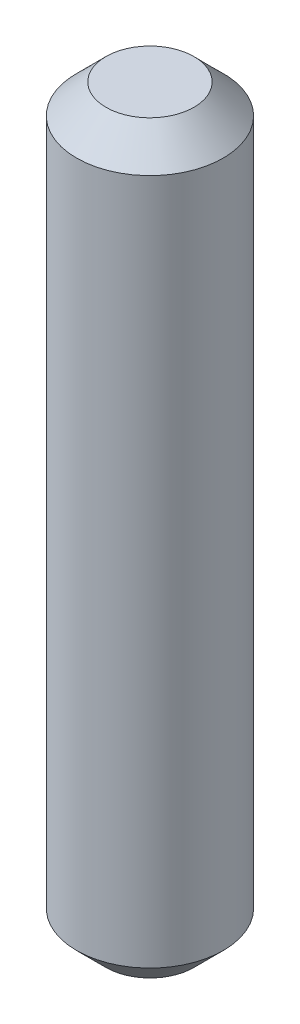
ISO-10303-21;
HEADER;
FILE_DESCRIPTION(('STEP AP214'),'2;1');
FILE_NAME('part.step','',(''),(''),'','','');
FILE_SCHEMA(('AUTOMOTIVE_DESIGN { 1 0 10303 214 1 1 1 1 }'));
ENDSEC;
DATA;
#1=APPLICATION_CONTEXT('core data for automotive mechanical design processes');
#2=APPLICATION_PROTOCOL_DEFINITION('international standard','automotive_design',2000,#1);
#3=PRODUCT_CONTEXT('',#1,'mechanical');
#4=PRODUCT('Part','Part','',(#3));
#5=PRODUCT_RELATED_PRODUCT_CATEGORY('part','',(#4));
#6=PRODUCT_DEFINITION_FORMATION('','',#4);
#7=PRODUCT_DEFINITION_CONTEXT('part definition',#1,'design');
#8=PRODUCT_DEFINITION('design','',#6,#7);
#9=PRODUCT_DEFINITION_SHAPE('','',#8);
#10=(LENGTH_UNIT() NAMED_UNIT(*) SI_UNIT(.MILLI.,.METRE.));
#11=(NAMED_UNIT(*) PLANE_ANGLE_UNIT() SI_UNIT($,.RADIAN.));
#12=(NAMED_UNIT(*) SI_UNIT($,.STERADIAN.) SOLID_ANGLE_UNIT());
#13=UNCERTAINTY_MEASURE_WITH_UNIT(LENGTH_MEASURE(1.E-05),#10,'distance_accuracy_value','');
#14=(GEOMETRIC_REPRESENTATION_CONTEXT(3) GLOBAL_UNCERTAINTY_ASSIGNED_CONTEXT((#13)) GLOBAL_UNIT_ASSIGNED_CONTEXT((#10,
#11,#12)) REPRESENTATION_CONTEXT('',''));
#15=CARTESIAN_POINT('',(0.,0.,0.));
#16=DIRECTION('',(0.,0.,1.));
#17=DIRECTION('',(1.,0.,0.));
#18=AXIS2_PLACEMENT_3D('',#15,#16,#17);
#19=CARTESIAN_POINT('',(0.,12.7,0.));
#20=DIRECTION('',(0.,-1.,0.));
#21=DIRECTION('',(0.,0.,-1.));
#22=AXIS2_PLACEMENT_3D('',#19,#20,#21);
#23=CYLINDRICAL_SURFACE('',#22,1.25);
#24=CARTESIAN_POINT('',(0.,0.500000000000004,0.));
#25=DIRECTION('',(0.,1.,0.));
#26=DIRECTION('',(0.,0.,1.));
#27=AXIS2_PLACEMENT_3D('',#24,#25,#26);
#28=CIRCLE('',#27,1.25);
#29=CARTESIAN_POINT('',(0.,0.500000000000004,1.25));
#30=VERTEX_POINT('',#29);
#31=EDGE_CURVE('E57',#30,#30,#28,.T.);
#32=ORIENTED_EDGE('',*,*,#31,.T.);
#33=EDGE_LOOP('',(#32));
#34=FACE_BOUND('',#33,.T.);
#35=CARTESIAN_POINT('',(0.,12.2,0.));
#36=DIRECTION('',(0.,1.,0.));
#37=DIRECTION('',(0.,0.,1.));
#38=AXIS2_PLACEMENT_3D('',#35,#36,#37);
#39=CIRCLE('',#38,1.25);
#40=CARTESIAN_POINT('',(0.,12.2,1.25));
#41=VERTEX_POINT('',#40);
#42=EDGE_CURVE('E61',#41,#41,#39,.F.);
#43=ORIENTED_EDGE('',*,*,#42,.T.);
#44=EDGE_LOOP('',(#43));
#45=FACE_BOUND('',#44,.T.);
#46=ADVANCED_FACE('F45',(#34,#45),#23,.T.);
#47=CARTESIAN_POINT('',(0.,12.7,0.));
#48=DIRECTION('',(0.,1.,0.));
#49=DIRECTION('',(0.,0.,1.));
#50=AXIS2_PLACEMENT_3D('',#47,#48,#49);
#51=PLANE('',#50);
#52=CARTESIAN_POINT('',(0.,12.7,0.));
#53=DIRECTION('',(0.,1.,0.));
#54=DIRECTION('',(0.,0.,1.));
#55=AXIS2_PLACEMENT_3D('',#52,#53,#54);
#56=CIRCLE('',#55,0.749999999999999);
#57=CARTESIAN_POINT('',(0.,12.7,0.749999999999999));
#58=VERTEX_POINT('',#57);
#59=EDGE_CURVE('E10',#58,#58,#56,.T.);
#60=ORIENTED_EDGE('',*,*,#59,.T.);
#61=EDGE_LOOP('',(#60));
#62=FACE_BOUND('',#61,.T.);
#63=ADVANCED_FACE('F76',(#62),#51,.T.);
#64=CARTESIAN_POINT('',(0.,0.,0.));
#65=DIRECTION('',(0.,1.,0.));
#66=DIRECTION('',(0.,0.,1.));
#67=AXIS2_PLACEMENT_3D('',#64,#65,#66);
#68=PLANE('',#67);
#69=CARTESIAN_POINT('',(0.,0.,0.));
#70=DIRECTION('',(0.,1.,0.));
#71=DIRECTION('',(0.,0.,1.));
#72=AXIS2_PLACEMENT_3D('',#69,#70,#71);
#73=CIRCLE('',#72,0.749999999999995);
#74=CARTESIAN_POINT('',(0.,0.,0.749999999999995));
#75=VERTEX_POINT('',#74);
#76=EDGE_CURVE('E53',#75,#75,#73,.F.);
#77=ORIENTED_EDGE('',*,*,#76,.T.);
#78=EDGE_LOOP('',(#77));
#79=FACE_BOUND('',#78,.T.);
#80=ADVANCED_FACE('F73',(#79),#68,.F.);
#81=CARTESIAN_POINT('',(0.,0.500000000000004,0.));
#82=DIRECTION('',(0.,1.,0.));
#83=DIRECTION('',(0.,0.,1.));
#84=AXIS2_PLACEMENT_3D('',#81,#82,#83);
#85=CONICAL_SURFACE('',#84,1.25,0.785398163397449);
#86=ORIENTED_EDGE('',*,*,#76,.F.);
#87=EDGE_LOOP('',(#86));
#88=FACE_BOUND('',#87,.T.);
#89=ORIENTED_EDGE('',*,*,#31,.F.);
#90=EDGE_LOOP('',(#89));
#91=FACE_BOUND('',#90,.T.);
#92=ADVANCED_FACE('F70',(#88,#91),#85,.T.);
#93=CARTESIAN_POINT('',(0.,12.7,0.));
#94=DIRECTION('',(0.,-1.,0.));
#95=DIRECTION('',(0.,0.,-1.));
#96=AXIS2_PLACEMENT_3D('',#93,#94,#95);
#97=CONICAL_SURFACE('',#96,0.749999999999999,0.785398163397446);
#98=ORIENTED_EDGE('',*,*,#42,.F.);
#99=EDGE_LOOP('',(#98));
#100=FACE_BOUND('',#99,.T.);
#101=ORIENTED_EDGE('',*,*,#59,.F.);
#102=EDGE_LOOP('',(#101));
#103=FACE_BOUND('',#102,.T.);
#104=ADVANCED_FACE('F48',(#100,#103),#97,.T.);
#105=CLOSED_SHELL('',(#46,#63,#80,#92,#104));
#106=MANIFOLD_SOLID_BREP('B2',#105);
#107=ADVANCED_BREP_SHAPE_REPRESENTATION('',(#18,#106),#14);
#108=SHAPE_DEFINITION_REPRESENTATION(#9,#107);
ENDSEC;
END-ISO-10303-21;
